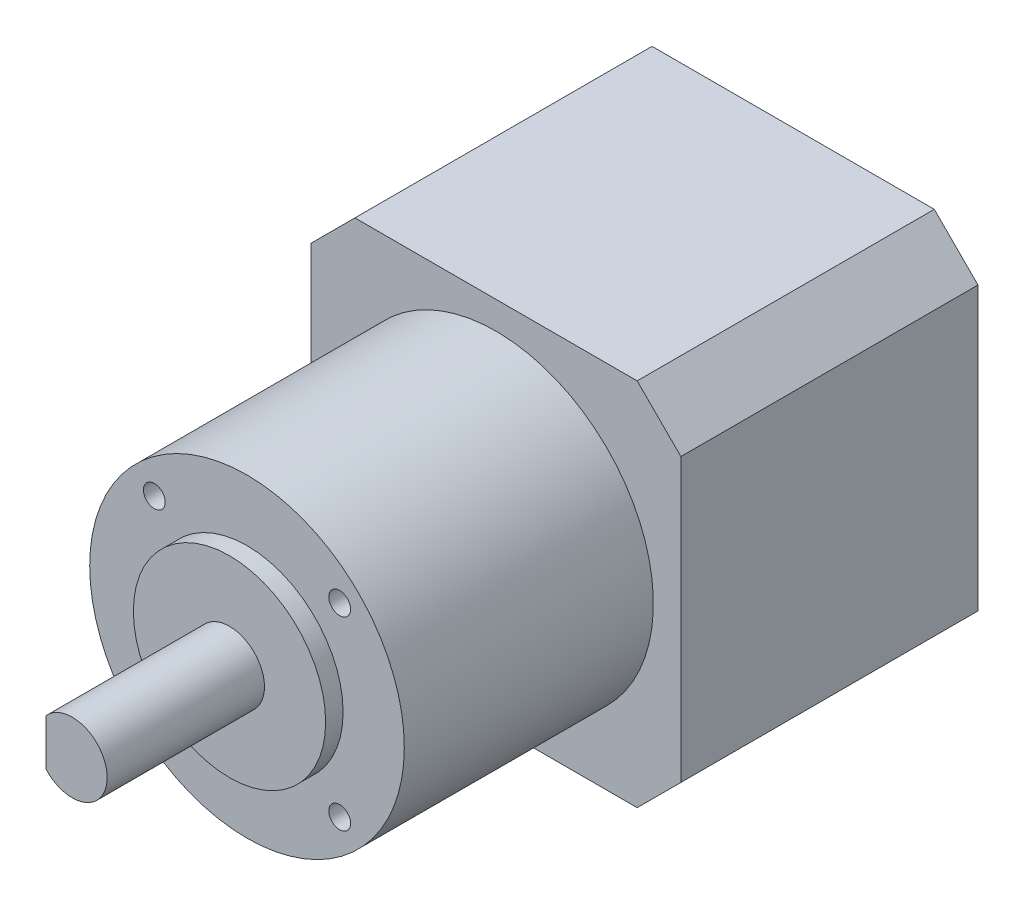
ISO-10303-21;
HEADER;
FILE_DESCRIPTION(('STEP AP214'),'2;1');
FILE_NAME('part.step','',(''),(''),'','','');
FILE_SCHEMA(('AUTOMOTIVE_DESIGN { 1 0 10303 214 1 1 1 1 }'));
ENDSEC;
DATA;
#1=APPLICATION_CONTEXT('core data for automotive mechanical design processes');
#2=APPLICATION_PROTOCOL_DEFINITION('international standard','automotive_design',2000,#1);
#3=PRODUCT_CONTEXT('',#1,'mechanical');
#4=PRODUCT('Part','Part','',(#3));
#5=PRODUCT_RELATED_PRODUCT_CATEGORY('part','',(#4));
#6=PRODUCT_DEFINITION_FORMATION('','',#4);
#7=PRODUCT_DEFINITION_CONTEXT('part definition',#1,'design');
#8=PRODUCT_DEFINITION('design','',#6,#7);
#9=PRODUCT_DEFINITION_SHAPE('','',#8);
#10=(LENGTH_UNIT() NAMED_UNIT(*) SI_UNIT(.MILLI.,.METRE.));
#11=(NAMED_UNIT(*) PLANE_ANGLE_UNIT() SI_UNIT($,.RADIAN.));
#12=(NAMED_UNIT(*) SI_UNIT($,.STERADIAN.) SOLID_ANGLE_UNIT());
#13=UNCERTAINTY_MEASURE_WITH_UNIT(LENGTH_MEASURE(1.E-05),#10,'distance_accuracy_value','');
#14=(GEOMETRIC_REPRESENTATION_CONTEXT(3) GLOBAL_UNCERTAINTY_ASSIGNED_CONTEXT((#13)) GLOBAL_UNIT_ASSIGNED_CONTEXT((#10,
#11,#12)) REPRESENTATION_CONTEXT('',''));
#15=CARTESIAN_POINT('',(0.,0.,0.));
#16=DIRECTION('',(0.,0.,1.));
#17=DIRECTION('',(1.,0.,0.));
#18=AXIS2_PLACEMENT_3D('',#15,#16,#17);
#19=CARTESIAN_POINT('',(-21.1500000000001,-16.15,34.));
#20=DIRECTION('',(1.,0.,0.));
#21=DIRECTION('',(0.,0.,-1.));
#22=AXIS2_PLACEMENT_3D('',#19,#20,#21);
#23=PLANE('',#22);
#24=DIRECTION('',(0.,-1.,0.));
#25=VECTOR('',#24,1.);
#26=CARTESIAN_POINT('',(-21.15,-16.15,0.));
#27=LINE('',#26,#25);
#28=CARTESIAN_POINT('',(-21.15,16.15,0.));
#29=VERTEX_POINT('',#28);
#30=CARTESIAN_POINT('',(-21.15,-16.15,0.));
#31=VERTEX_POINT('',#30);
#32=EDGE_CURVE('E148',#29,#31,#27,.T.);
#33=ORIENTED_EDGE('',*,*,#32,.T.);
#34=DIRECTION('',(0.,0.,-1.));
#35=VECTOR('',#34,1.);
#36=CARTESIAN_POINT('',(-21.1500000000001,-16.15,34.));
#37=LINE('',#36,#35);
#38=CARTESIAN_POINT('',(-21.1500000000001,-16.15,34.));
#39=VERTEX_POINT('',#38);
#40=EDGE_CURVE('E188',#39,#31,#37,.T.);
#41=ORIENTED_EDGE('',*,*,#40,.F.);
#42=DIRECTION('',(0.,-1.,0.));
#43=VECTOR('',#42,1.);
#44=CARTESIAN_POINT('',(-21.1500000000001,-16.15,34.));
#45=LINE('',#44,#43);
#46=CARTESIAN_POINT('',(-21.15,16.15,34.));
#47=VERTEX_POINT('',#46);
#48=EDGE_CURVE('E170',#47,#39,#45,.T.);
#49=ORIENTED_EDGE('',*,*,#48,.F.);
#50=DIRECTION('',(0.,0.,-1.));
#51=VECTOR('',#50,1.);
#52=CARTESIAN_POINT('',(-21.15,16.15,34.));
#53=LINE('',#52,#51);
#54=EDGE_CURVE('E144',#47,#29,#53,.T.);
#55=ORIENTED_EDGE('',*,*,#54,.T.);
#56=EDGE_LOOP('',(#33,#41,#49,#55));
#57=FACE_BOUND('',#56,.T.);
#58=ADVANCED_FACE('F40',(#57),#23,.F.);
#59=CARTESIAN_POINT('',(-21.1500000000001,-16.15,34.));
#60=DIRECTION('',(0.707106781186548,0.707106781186548,0.));
#61=DIRECTION('',(-0.707106781186549,0.707106781186549,0.));
#62=AXIS2_PLACEMENT_3D('',#59,#60,#61);
#63=PLANE('',#62);
#64=DIRECTION('',(0.707106781186549,-0.707106781186549,0.));
#65=VECTOR('',#64,1.);
#66=CARTESIAN_POINT('',(-21.15,-16.15,0.));
#67=LINE('',#66,#65);
#68=CARTESIAN_POINT('',(-16.15,-21.15,0.));
#69=VERTEX_POINT('',#68);
#70=EDGE_CURVE('E152',#31,#69,#67,.T.);
#71=ORIENTED_EDGE('',*,*,#70,.T.);
#72=DIRECTION('',(0.,0.,-1.));
#73=VECTOR('',#72,1.);
#74=CARTESIAN_POINT('',(-16.15,-21.15,34.));
#75=LINE('',#74,#73);
#76=CARTESIAN_POINT('',(-16.15,-21.15,34.));
#77=VERTEX_POINT('',#76);
#78=EDGE_CURVE('E185',#77,#69,#75,.T.);
#79=ORIENTED_EDGE('',*,*,#78,.F.);
#80=DIRECTION('',(0.707106781186549,-0.707106781186549,0.));
#81=VECTOR('',#80,1.);
#82=CARTESIAN_POINT('',(-21.1500000000001,-16.15,34.));
#83=LINE('',#82,#81);
#84=EDGE_CURVE('E105',#39,#77,#83,.T.);
#85=ORIENTED_EDGE('',*,*,#84,.F.);
#86=ORIENTED_EDGE('',*,*,#40,.T.);
#87=EDGE_LOOP('',(#71,#79,#85,#86));
#88=FACE_BOUND('',#87,.T.);
#89=ADVANCED_FACE('F251',(#88),#63,.F.);
#90=CARTESIAN_POINT('',(-16.15,-21.15,34.));
#91=DIRECTION('',(0.,1.,0.));
#92=DIRECTION('',(0.,0.,1.));
#93=AXIS2_PLACEMENT_3D('',#90,#91,#92);
#94=PLANE('',#93);
#95=DIRECTION('',(1.,0.,0.));
#96=VECTOR('',#95,1.);
#97=CARTESIAN_POINT('',(-16.15,-21.15,0.));
#98=LINE('',#97,#96);
#99=CARTESIAN_POINT('',(16.15,-21.15,0.));
#100=VERTEX_POINT('',#99);
#101=EDGE_CURVE('E155',#69,#100,#98,.T.);
#102=ORIENTED_EDGE('',*,*,#101,.T.);
#103=DIRECTION('',(0.,0.,-1.));
#104=VECTOR('',#103,1.);
#105=CARTESIAN_POINT('',(16.15,-21.15,34.));
#106=LINE('',#105,#104);
#107=CARTESIAN_POINT('',(16.15,-21.15,34.));
#108=VERTEX_POINT('',#107);
#109=EDGE_CURVE('E181',#108,#100,#106,.T.);
#110=ORIENTED_EDGE('',*,*,#109,.F.);
#111=DIRECTION('',(1.,0.,0.));
#112=VECTOR('',#111,1.);
#113=CARTESIAN_POINT('',(-16.15,-21.15,34.));
#114=LINE('',#113,#112);
#115=EDGE_CURVE('E231',#77,#108,#114,.T.);
#116=ORIENTED_EDGE('',*,*,#115,.F.);
#117=ORIENTED_EDGE('',*,*,#78,.T.);
#118=EDGE_LOOP('',(#102,#110,#116,#117));
#119=FACE_BOUND('',#118,.T.);
#120=ADVANCED_FACE('F254',(#119),#94,.F.);
#121=CARTESIAN_POINT('',(16.15,-21.15,34.));
#122=DIRECTION('',(-0.707106781186548,0.707106781186548,0.));
#123=DIRECTION('',(-0.707106781186549,-0.707106781186549,0.));
#124=AXIS2_PLACEMENT_3D('',#121,#122,#123);
#125=PLANE('',#124);
#126=DIRECTION('',(0.707106781186549,0.707106781186549,0.));
#127=VECTOR('',#126,1.);
#128=CARTESIAN_POINT('',(16.15,-21.15,0.));
#129=LINE('',#128,#127);
#130=CARTESIAN_POINT('',(21.15,-16.15,0.));
#131=VERTEX_POINT('',#130);
#132=EDGE_CURVE('E158',#100,#131,#129,.T.);
#133=ORIENTED_EDGE('',*,*,#132,.T.);
#134=DIRECTION('',(0.,0.,-1.));
#135=VECTOR('',#134,1.);
#136=CARTESIAN_POINT('',(21.15,-16.15,34.));
#137=LINE('',#136,#135);
#138=CARTESIAN_POINT('',(21.15,-16.15,34.));
#139=VERTEX_POINT('',#138);
#140=EDGE_CURVE('E177',#139,#131,#137,.T.);
#141=ORIENTED_EDGE('',*,*,#140,.F.);
#142=DIRECTION('',(0.707106781186549,0.707106781186549,0.));
#143=VECTOR('',#142,1.);
#144=CARTESIAN_POINT('',(16.15,-21.15,34.));
#145=LINE('',#144,#143);
#146=EDGE_CURVE('E233',#108,#139,#145,.T.);
#147=ORIENTED_EDGE('',*,*,#146,.F.);
#148=ORIENTED_EDGE('',*,*,#109,.T.);
#149=EDGE_LOOP('',(#133,#141,#147,#148));
#150=FACE_BOUND('',#149,.T.);
#151=ADVANCED_FACE('F239',(#150),#125,.F.);
#152=CARTESIAN_POINT('',(21.15,-16.15,34.));
#153=DIRECTION('',(-1.,0.,0.));
#154=DIRECTION('',(0.,0.,1.));
#155=AXIS2_PLACEMENT_3D('',#152,#153,#154);
#156=PLANE('',#155);
#157=DIRECTION('',(0.,1.,0.));
#158=VECTOR('',#157,1.);
#159=CARTESIAN_POINT('',(21.15,-16.15,0.));
#160=LINE('',#159,#158);
#161=CARTESIAN_POINT('',(21.15,16.15,0.));
#162=VERTEX_POINT('',#161);
#163=EDGE_CURVE('E160',#131,#162,#160,.T.);
#164=ORIENTED_EDGE('',*,*,#163,.T.);
#165=DIRECTION('',(0.,0.,-1.));
#166=VECTOR('',#165,1.);
#167=CARTESIAN_POINT('',(21.15,16.15,34.));
#168=LINE('',#167,#166);
#169=CARTESIAN_POINT('',(21.15,16.15,34.));
#170=VERTEX_POINT('',#169);
#171=EDGE_CURVE('E139',#170,#162,#168,.T.);
#172=ORIENTED_EDGE('',*,*,#171,.F.);
#173=DIRECTION('',(0.,1.,0.));
#174=VECTOR('',#173,1.);
#175=CARTESIAN_POINT('',(21.15,-16.15,34.));
#176=LINE('',#175,#174);
#177=EDGE_CURVE('E127',#139,#170,#176,.T.);
#178=ORIENTED_EDGE('',*,*,#177,.F.);
#179=ORIENTED_EDGE('',*,*,#140,.T.);
#180=EDGE_LOOP('',(#164,#172,#178,#179));
#181=FACE_BOUND('',#180,.T.);
#182=ADVANCED_FACE('F243',(#181),#156,.F.);
#183=CARTESIAN_POINT('',(16.15,21.15,34.));
#184=DIRECTION('',(-0.707106781186548,-0.707106781186548,0.));
#185=DIRECTION('',(0.707106781186549,-0.707106781186549,0.));
#186=AXIS2_PLACEMENT_3D('',#183,#184,#185);
#187=PLANE('',#186);
#188=DIRECTION('',(-0.707106781186549,0.707106781186549,0.));
#189=VECTOR('',#188,1.);
#190=CARTESIAN_POINT('',(16.15,21.15,0.));
#191=LINE('',#190,#189);
#192=CARTESIAN_POINT('',(16.15,21.15,0.));
#193=VERTEX_POINT('',#192);
#194=EDGE_CURVE('E136',#162,#193,#191,.T.);
#195=ORIENTED_EDGE('',*,*,#194,.T.);
#196=DIRECTION('',(0.,0.,-1.));
#197=VECTOR('',#196,1.);
#198=CARTESIAN_POINT('',(16.15,21.15,34.));
#199=LINE('',#198,#197);
#200=CARTESIAN_POINT('',(16.15,21.15,34.));
#201=VERTEX_POINT('',#200);
#202=EDGE_CURVE('E133',#201,#193,#199,.T.);
#203=ORIENTED_EDGE('',*,*,#202,.F.);
#204=DIRECTION('',(-0.707106781186549,0.707106781186549,0.));
#205=VECTOR('',#204,1.);
#206=CARTESIAN_POINT('',(16.15,21.15,34.));
#207=LINE('',#206,#205);
#208=EDGE_CURVE('E120',#170,#201,#207,.T.);
#209=ORIENTED_EDGE('',*,*,#208,.F.);
#210=ORIENTED_EDGE('',*,*,#171,.T.);
#211=EDGE_LOOP('',(#195,#203,#209,#210));
#212=FACE_BOUND('',#211,.T.);
#213=ADVANCED_FACE('F134',(#212),#187,.F.);
#214=CARTESIAN_POINT('',(-16.15,21.15,34.));
#215=DIRECTION('',(0.,-1.,0.));
#216=DIRECTION('',(0.,0.,-1.));
#217=AXIS2_PLACEMENT_3D('',#214,#215,#216);
#218=PLANE('',#217);
#219=DIRECTION('',(-1.,0.,0.));
#220=VECTOR('',#219,1.);
#221=CARTESIAN_POINT('',(-16.15,21.15,0.));
#222=LINE('',#221,#220);
#223=CARTESIAN_POINT('',(-16.15,21.15,0.));
#224=VERTEX_POINT('',#223);
#225=EDGE_CURVE('E165',#193,#224,#222,.T.);
#226=ORIENTED_EDGE('',*,*,#225,.T.);
#227=DIRECTION('',(0.,0.,-1.));
#228=VECTOR('',#227,1.);
#229=CARTESIAN_POINT('',(-16.15,21.15,34.));
#230=LINE('',#229,#228);
#231=CARTESIAN_POINT('',(-16.15,21.15,34.));
#232=VERTEX_POINT('',#231);
#233=EDGE_CURVE('E140',#232,#224,#230,.T.);
#234=ORIENTED_EDGE('',*,*,#233,.F.);
#235=DIRECTION('',(-1.,0.,0.));
#236=VECTOR('',#235,1.);
#237=CARTESIAN_POINT('',(-16.15,21.15,34.));
#238=LINE('',#237,#236);
#239=EDGE_CURVE('E124',#201,#232,#238,.T.);
#240=ORIENTED_EDGE('',*,*,#239,.F.);
#241=ORIENTED_EDGE('',*,*,#202,.T.);
#242=EDGE_LOOP('',(#226,#234,#240,#241));
#243=FACE_BOUND('',#242,.T.);
#244=ADVANCED_FACE('F142',(#243),#218,.F.);
#245=CARTESIAN_POINT('',(-21.15,16.15,34.));
#246=DIRECTION('',(0.707106781186548,-0.707106781186548,0.));
#247=DIRECTION('',(0.707106781186549,0.707106781186549,0.));
#248=AXIS2_PLACEMENT_3D('',#245,#246,#247);
#249=PLANE('',#248);
#250=DIRECTION('',(-0.707106781186549,-0.707106781186549,0.));
#251=VECTOR('',#250,1.);
#252=CARTESIAN_POINT('',(-21.15,16.15,0.));
#253=LINE('',#252,#251);
#254=EDGE_CURVE('E96',#224,#29,#253,.T.);
#255=ORIENTED_EDGE('',*,*,#254,.T.);
#256=ORIENTED_EDGE('',*,*,#54,.F.);
#257=DIRECTION('',(-0.707106781186549,-0.707106781186549,0.));
#258=VECTOR('',#257,1.);
#259=CARTESIAN_POINT('',(-21.15,16.15,34.));
#260=LINE('',#259,#258);
#261=EDGE_CURVE('E63',#232,#47,#260,.T.);
#262=ORIENTED_EDGE('',*,*,#261,.F.);
#263=ORIENTED_EDGE('',*,*,#233,.T.);
#264=EDGE_LOOP('',(#255,#256,#262,#263));
#265=FACE_BOUND('',#264,.T.);
#266=ADVANCED_FACE('F247',(#265),#249,.F.);
#267=CARTESIAN_POINT('',(0.,0.,34.));
#268=DIRECTION('',(0.,0.,-1.));
#269=DIRECTION('',(-1.,0.,0.));
#270=AXIS2_PLACEMENT_3D('',#267,#268,#269);
#271=PLANE('',#270);
#272=CARTESIAN_POINT('',(0.,0.,34.));
#273=DIRECTION('',(0.,0.,-1.));
#274=DIRECTION('',(-1.,0.,0.));
#275=AXIS2_PLACEMENT_3D('',#272,#273,#274);
#276=CIRCLE('',#275,18.);
#277=CARTESIAN_POINT('',(-18.,0.,34.));
#278=VERTEX_POINT('',#277);
#279=EDGE_CURVE('E190',#278,#278,#276,.F.);
#280=ORIENTED_EDGE('',*,*,#279,.F.);
#281=EDGE_LOOP('',(#280));
#282=FACE_BOUND('',#281,.T.);
#283=ORIENTED_EDGE('',*,*,#48,.T.);
#284=ORIENTED_EDGE('',*,*,#84,.T.);
#285=ORIENTED_EDGE('',*,*,#115,.T.);
#286=ORIENTED_EDGE('',*,*,#146,.T.);
#287=ORIENTED_EDGE('',*,*,#177,.T.);
#288=ORIENTED_EDGE('',*,*,#208,.T.);
#289=ORIENTED_EDGE('',*,*,#239,.T.);
#290=ORIENTED_EDGE('',*,*,#261,.T.);
#291=EDGE_LOOP('',(#283,#284,#285,#286,#287,#288,#289,#290));
#292=FACE_BOUND('',#291,.T.);
#293=ADVANCED_FACE('F122',(#282,#292),#271,.F.);
#294=CARTESIAN_POINT('',(0.,0.,0.));
#295=DIRECTION('',(0.,0.,-1.));
#296=DIRECTION('',(-1.,0.,0.));
#297=AXIS2_PLACEMENT_3D('',#294,#295,#296);
#298=PLANE('',#297);
#299=ORIENTED_EDGE('',*,*,#32,.F.);
#300=ORIENTED_EDGE('',*,*,#254,.F.);
#301=ORIENTED_EDGE('',*,*,#225,.F.);
#302=ORIENTED_EDGE('',*,*,#194,.F.);
#303=ORIENTED_EDGE('',*,*,#163,.F.);
#304=ORIENTED_EDGE('',*,*,#132,.F.);
#305=ORIENTED_EDGE('',*,*,#101,.F.);
#306=ORIENTED_EDGE('',*,*,#70,.F.);
#307=EDGE_LOOP('',(#299,#300,#301,#302,#303,#304,#305,#306));
#308=FACE_BOUND('',#307,.T.);
#309=ADVANCED_FACE('F246',(#308),#298,.T.);
#310=CARTESIAN_POINT('',(0.,0.,62.5));
#311=DIRECTION('',(0.,0.,-1.));
#312=DIRECTION('',(-1.,0.,0.));
#313=AXIS2_PLACEMENT_3D('',#310,#311,#312);
#314=CYLINDRICAL_SURFACE('',#313,18.);
#315=CARTESIAN_POINT('',(0.,0.,62.5));
#316=DIRECTION('',(0.,0.,1.));
#317=DIRECTION('',(1.,0.,0.));
#318=AXIS2_PLACEMENT_3D('',#315,#316,#317);
#319=CIRCLE('',#318,18.);
#320=CARTESIAN_POINT('',(18.,0.,62.5));
#321=VERTEX_POINT('',#320);
#322=EDGE_CURVE('E153',#321,#321,#319,.T.);
#323=ORIENTED_EDGE('',*,*,#322,.F.);
#324=EDGE_LOOP('',(#323));
#325=FACE_BOUND('',#324,.T.);
#326=ORIENTED_EDGE('',*,*,#279,.T.);
#327=EDGE_LOOP('',(#326));
#328=FACE_BOUND('',#327,.T.);
#329=ADVANCED_FACE('F334',(#325,#328),#314,.T.);
#330=CARTESIAN_POINT('',(0.,0.,62.5));
#331=DIRECTION('',(0.,0.,1.));
#332=DIRECTION('',(1.,0.,0.));
#333=AXIS2_PLACEMENT_3D('',#330,#331,#332);
#334=PLANE('',#333);
#335=CARTESIAN_POINT('',(-10.6066017177982,10.6066017177982,62.5));
#336=DIRECTION('',(0.,0.,1.));
#337=DIRECTION('',(1.,0.,0.));
#338=AXIS2_PLACEMENT_3D('',#335,#336,#337);
#339=CIRCLE('',#338,1.24999999999999);
#340=CARTESIAN_POINT('',(-9.35660171779822,10.6066017177982,62.5));
#341=VERTEX_POINT('',#340);
#342=EDGE_CURVE('E513',#341,#341,#339,.T.);
#343=ORIENTED_EDGE('',*,*,#342,.F.);
#344=EDGE_LOOP('',(#343));
#345=FACE_BOUND('',#344,.T.);
#346=CARTESIAN_POINT('',(10.6066017177982,10.6066017177982,62.5));
#347=DIRECTION('',(0.,0.,1.));
#348=DIRECTION('',(1.,0.,0.));
#349=AXIS2_PLACEMENT_3D('',#346,#347,#348);
#350=CIRCLE('',#349,1.24999999999999);
#351=CARTESIAN_POINT('',(11.8566017177982,10.6066017177982,62.5));
#352=VERTEX_POINT('',#351);
#353=EDGE_CURVE('E517',#352,#352,#350,.T.);
#354=ORIENTED_EDGE('',*,*,#353,.F.);
#355=EDGE_LOOP('',(#354));
#356=FACE_BOUND('',#355,.T.);
#357=CARTESIAN_POINT('',(-10.6066017177982,-10.6066017177982,62.5));
#358=DIRECTION('',(0.,0.,1.));
#359=DIRECTION('',(1.,0.,0.));
#360=AXIS2_PLACEMENT_3D('',#357,#358,#359);
#361=CIRCLE('',#360,1.24999999999999);
#362=CARTESIAN_POINT('',(-9.35660171779823,-10.6066017177982,62.5));
#363=VERTEX_POINT('',#362);
#364=EDGE_CURVE('E525',#363,#363,#361,.T.);
#365=ORIENTED_EDGE('',*,*,#364,.F.);
#366=EDGE_LOOP('',(#365));
#367=FACE_BOUND('',#366,.T.);
#368=CARTESIAN_POINT('',(10.6066017177982,-10.6066017177982,62.5));
#369=DIRECTION('',(0.,0.,1.));
#370=DIRECTION('',(1.,0.,0.));
#371=AXIS2_PLACEMENT_3D('',#368,#369,#370);
#372=CIRCLE('',#371,1.24999999999999);
#373=CARTESIAN_POINT('',(11.8566017177982,-10.6066017177982,62.5));
#374=VERTEX_POINT('',#373);
#375=EDGE_CURVE('E532',#374,#374,#372,.T.);
#376=ORIENTED_EDGE('',*,*,#375,.F.);
#377=EDGE_LOOP('',(#376));
#378=FACE_BOUND('',#377,.T.);
#379=CARTESIAN_POINT('',(0.,0.,62.5));
#380=DIRECTION('',(0.,0.,1.));
#381=DIRECTION('',(1.,0.,0.));
#382=AXIS2_PLACEMENT_3D('',#379,#380,#381);
#383=CIRCLE('',#382,11.);
#384=CARTESIAN_POINT('',(11.,0.,62.5));
#385=VERTEX_POINT('',#384);
#386=EDGE_CURVE('E213',#385,#385,#383,.T.);
#387=ORIENTED_EDGE('',*,*,#386,.F.);
#388=EDGE_LOOP('',(#387));
#389=FACE_BOUND('',#388,.T.);
#390=ORIENTED_EDGE('',*,*,#322,.T.);
#391=EDGE_LOOP('',(#390));
#392=FACE_BOUND('',#391,.T.);
#393=ADVANCED_FACE('F342',(#345,#356,#367,#378,#389,#392),#334,.T.);
#394=CARTESIAN_POINT('',(0.,0.,64.5));
#395=DIRECTION('',(0.,0.,-1.));
#396=DIRECTION('',(-1.,0.,0.));
#397=AXIS2_PLACEMENT_3D('',#394,#395,#396);
#398=CYLINDRICAL_SURFACE('',#397,11.);
#399=CARTESIAN_POINT('',(0.,0.,64.5));
#400=DIRECTION('',(0.,0.,1.));
#401=DIRECTION('',(1.,0.,0.));
#402=AXIS2_PLACEMENT_3D('',#399,#400,#401);
#403=CIRCLE('',#402,11.);
#404=CARTESIAN_POINT('',(11.,0.,64.5));
#405=VERTEX_POINT('',#404);
#406=EDGE_CURVE('E217',#405,#405,#403,.T.);
#407=ORIENTED_EDGE('',*,*,#406,.F.);
#408=EDGE_LOOP('',(#407));
#409=FACE_BOUND('',#408,.T.);
#410=ORIENTED_EDGE('',*,*,#386,.T.);
#411=EDGE_LOOP('',(#410));
#412=FACE_BOUND('',#411,.T.);
#413=ADVANCED_FACE('F351',(#409,#412),#398,.T.);
#414=CARTESIAN_POINT('',(0.,0.,64.5));
#415=DIRECTION('',(0.,0.,1.));
#416=DIRECTION('',(1.,0.,0.));
#417=AXIS2_PLACEMENT_3D('',#414,#415,#416);
#418=PLANE('',#417);
#419=CARTESIAN_POINT('',(0.,0.,64.5));
#420=DIRECTION('',(0.,0.,1.));
#421=DIRECTION('',(1.,0.,0.));
#422=AXIS2_PLACEMENT_3D('',#419,#420,#421);
#423=CIRCLE('',#422,4.);
#424=CARTESIAN_POINT('',(4.00000000000001,0.,64.5));
#425=VERTEX_POINT('',#424);
#426=EDGE_CURVE('E214',#425,#425,#423,.T.);
#427=ORIENTED_EDGE('',*,*,#426,.F.);
#428=EDGE_LOOP('',(#427));
#429=FACE_BOUND('',#428,.T.);
#430=ORIENTED_EDGE('',*,*,#406,.T.);
#431=EDGE_LOOP('',(#430));
#432=FACE_BOUND('',#431,.T.);
#433=ADVANCED_FACE('F360',(#429,#432),#418,.T.);
#434=CARTESIAN_POINT('',(0.,0.,82.5));
#435=DIRECTION('',(0.,0.,-1.));
#436=DIRECTION('',(-1.,0.,0.));
#437=AXIS2_PLACEMENT_3D('',#434,#435,#436);
#438=CYLINDRICAL_SURFACE('',#437,4.);
#439=CARTESIAN_POINT('',(0.,0.,82.5));
#440=DIRECTION('',(0.,0.,1.));
#441=DIRECTION('',(1.,0.,0.));
#442=AXIS2_PLACEMENT_3D('',#439,#440,#441);
#443=CIRCLE('',#442,4.);
#444=CARTESIAN_POINT('',(-3.,-2.64575131106459,82.5));
#445=VERTEX_POINT('',#444);
#446=CARTESIAN_POINT('',(-3.00000000000001,2.64575131106459,82.5));
#447=VERTEX_POINT('',#446);
#448=EDGE_CURVE('E208',#445,#447,#443,.T.);
#449=ORIENTED_EDGE('',*,*,#448,.F.);
#450=DIRECTION('',(0.,0.,-1.));
#451=VECTOR('',#450,1.);
#452=CARTESIAN_POINT('',(-3.,-2.64575131106459,82.5));
#453=LINE('',#452,#451);
#454=CARTESIAN_POINT('',(-3.,-2.64575131106461,67.5));
#455=VERTEX_POINT('',#454);
#456=EDGE_CURVE('E54',#445,#455,#453,.T.);
#457=ORIENTED_EDGE('',*,*,#456,.T.);
#458=CARTESIAN_POINT('',(0.,0.,67.5));
#459=DIRECTION('',(0.,0.,-1.));
#460=DIRECTION('',(-1.,0.,0.));
#461=AXIS2_PLACEMENT_3D('',#458,#459,#460);
#462=CIRCLE('',#461,4.);
#463=CARTESIAN_POINT('',(-3.,2.64575131106459,67.5));
#464=VERTEX_POINT('',#463);
#465=EDGE_CURVE('E11',#455,#464,#462,.T.);
#466=ORIENTED_EDGE('',*,*,#465,.T.);
#467=DIRECTION('',(0.,0.,-1.));
#468=VECTOR('',#467,1.);
#469=CARTESIAN_POINT('',(-3.00000000000001,2.64575131106459,82.5));
#470=LINE('',#469,#468);
#471=EDGE_CURVE('E197',#464,#447,#470,.F.);
#472=ORIENTED_EDGE('',*,*,#471,.T.);
#473=EDGE_LOOP('',(#449,#457,#466,#472));
#474=FACE_BOUND('',#473,.T.);
#475=ORIENTED_EDGE('',*,*,#426,.T.);
#476=EDGE_LOOP('',(#475));
#477=FACE_BOUND('',#476,.T.);
#478=ADVANCED_FACE('F206',(#474,#477),#438,.T.);
#479=CARTESIAN_POINT('',(0.,0.,82.5));
#480=DIRECTION('',(0.,0.,1.));
#481=DIRECTION('',(1.,0.,0.));
#482=AXIS2_PLACEMENT_3D('',#479,#480,#481);
#483=PLANE('',#482);
#484=DIRECTION('',(0.,1.,0.));
#485=VECTOR('',#484,1.);
#486=CARTESIAN_POINT('',(-3.,0.,82.5));
#487=LINE('',#486,#485);
#488=EDGE_CURVE('E47',#445,#447,#487,.T.);
#489=ORIENTED_EDGE('',*,*,#488,.F.);
#490=ORIENTED_EDGE('',*,*,#448,.T.);
#491=EDGE_LOOP('',(#489,#490));
#492=FACE_BOUND('',#491,.T.);
#493=ADVANCED_FACE('F212',(#492),#483,.T.);
#494=CARTESIAN_POINT('',(0.,0.,67.5));
#495=DIRECTION('',(0.,0.,-1.));
#496=DIRECTION('',(-1.,0.,0.));
#497=AXIS2_PLACEMENT_3D('',#494,#495,#496);
#498=PLANE('',#497);
#499=DIRECTION('',(0.,1.,0.));
#500=VECTOR('',#499,1.);
#501=CARTESIAN_POINT('',(-3.,5.3779483719381,67.5));
#502=LINE('',#501,#500);
#503=EDGE_CURVE('E210',#455,#464,#502,.T.);
#504=ORIENTED_EDGE('',*,*,#503,.T.);
#505=ORIENTED_EDGE('',*,*,#465,.F.);
#506=EDGE_LOOP('',(#504,#505));
#507=FACE_BOUND('',#506,.T.);
#508=ADVANCED_FACE('F388',(#507),#498,.F.);
#509=CARTESIAN_POINT('',(-3.,5.3779483719381,67.5));
#510=DIRECTION('',(1.,0.,0.));
#511=DIRECTION('',(0.,1.,0.));
#512=AXIS2_PLACEMENT_3D('',#509,#510,#511);
#513=PLANE('',#512);
#514=ORIENTED_EDGE('',*,*,#488,.T.);
#515=ORIENTED_EDGE('',*,*,#471,.F.);
#516=ORIENTED_EDGE('',*,*,#503,.F.);
#517=ORIENTED_EDGE('',*,*,#456,.F.);
#518=EDGE_LOOP('',(#514,#515,#516,#517));
#519=FACE_BOUND('',#518,.T.);
#520=ADVANCED_FACE('F196',(#519),#513,.F.);
#521=CARTESIAN_POINT('',(10.6066017177982,-10.6066017177982,55.));
#522=DIRECTION('',(0.,0.,1.));
#523=DIRECTION('',(1.,0.,0.));
#524=AXIS2_PLACEMENT_3D('',#521,#522,#523);
#525=CONICAL_SURFACE('',#524,1.24999999999999,1.02974425867665);
#526=CARTESIAN_POINT('',(10.6066017177982,-10.6066017177982,54.2489242262155));
#527=VERTEX_POINT('',#526);
#528=VERTEX_LOOP('',#527);
#529=FACE_BOUND('',#528,.T.);
#530=CARTESIAN_POINT('',(10.6066017177982,-10.6066017177982,55.));
#531=DIRECTION('',(0.,0.,1.));
#532=DIRECTION('',(1.,0.,0.));
#533=AXIS2_PLACEMENT_3D('',#530,#531,#532);
#534=CIRCLE('',#533,1.24999999999999);
#535=CARTESIAN_POINT('',(11.8566017177982,-10.6066017177982,55.));
#536=VERTEX_POINT('',#535);
#537=EDGE_CURVE('E535',#536,#536,#534,.T.);
#538=ORIENTED_EDGE('',*,*,#537,.T.);
#539=EDGE_LOOP('',(#538));
#540=FACE_BOUND('',#539,.T.);
#541=ADVANCED_FACE('F406',(#529,#540),#525,.F.);
#542=CARTESIAN_POINT('',(10.6066017177982,-10.6066017177982,62.5));
#543=DIRECTION('',(0.,0.,1.));
#544=DIRECTION('',(1.,0.,0.));
#545=AXIS2_PLACEMENT_3D('',#542,#543,#544);
#546=CYLINDRICAL_SURFACE('',#545,1.24999999999999);
#547=ORIENTED_EDGE('',*,*,#537,.F.);
#548=EDGE_LOOP('',(#547));
#549=FACE_BOUND('',#548,.T.);
#550=ORIENTED_EDGE('',*,*,#375,.T.);
#551=EDGE_LOOP('',(#550));
#552=FACE_BOUND('',#551,.T.);
#553=ADVANCED_FACE('F415',(#549,#552),#546,.F.);
#554=CARTESIAN_POINT('',(-10.6066017177982,-10.6066017177982,55.));
#555=DIRECTION('',(0.,0.,1.));
#556=DIRECTION('',(1.,0.,0.));
#557=AXIS2_PLACEMENT_3D('',#554,#555,#556);
#558=CONICAL_SURFACE('',#557,1.24999999999999,1.02974425867665);
#559=CARTESIAN_POINT('',(-10.6066017177982,-10.6066017177982,54.2489242262155));
#560=VERTEX_POINT('',#559);
#561=VERTEX_LOOP('',#560);
#562=FACE_BOUND('',#561,.T.);
#563=CARTESIAN_POINT('',(-10.6066017177982,-10.6066017177982,55.));
#564=DIRECTION('',(0.,0.,1.));
#565=DIRECTION('',(1.,0.,0.));
#566=AXIS2_PLACEMENT_3D('',#563,#564,#565);
#567=CIRCLE('',#566,1.24999999999999);
#568=CARTESIAN_POINT('',(-9.35660171779823,-10.6066017177982,55.));
#569=VERTEX_POINT('',#568);
#570=EDGE_CURVE('E528',#569,#569,#567,.T.);
#571=ORIENTED_EDGE('',*,*,#570,.T.);
#572=EDGE_LOOP('',(#571));
#573=FACE_BOUND('',#572,.T.);
#574=ADVANCED_FACE('F426',(#562,#573),#558,.F.);
#575=CARTESIAN_POINT('',(-10.6066017177982,-10.6066017177982,62.5));
#576=DIRECTION('',(0.,0.,1.));
#577=DIRECTION('',(1.,0.,0.));
#578=AXIS2_PLACEMENT_3D('',#575,#576,#577);
#579=CYLINDRICAL_SURFACE('',#578,1.24999999999999);
#580=ORIENTED_EDGE('',*,*,#570,.F.);
#581=EDGE_LOOP('',(#580));
#582=FACE_BOUND('',#581,.T.);
#583=ORIENTED_EDGE('',*,*,#364,.T.);
#584=EDGE_LOOP('',(#583));
#585=FACE_BOUND('',#584,.T.);
#586=ADVANCED_FACE('F437',(#582,#585),#579,.F.);
#587=CARTESIAN_POINT('',(10.6066017177982,10.6066017177982,55.));
#588=DIRECTION('',(0.,0.,1.));
#589=DIRECTION('',(1.,0.,0.));
#590=AXIS2_PLACEMENT_3D('',#587,#588,#589);
#591=CONICAL_SURFACE('',#590,1.24999999999999,1.02974425867665);
#592=CARTESIAN_POINT('',(10.6066017177982,10.6066017177982,54.2489242262155));
#593=VERTEX_POINT('',#592);
#594=VERTEX_LOOP('',#593);
#595=FACE_BOUND('',#594,.T.);
#596=CARTESIAN_POINT('',(10.6066017177982,10.6066017177982,55.));
#597=DIRECTION('',(0.,0.,1.));
#598=DIRECTION('',(1.,0.,0.));
#599=AXIS2_PLACEMENT_3D('',#596,#597,#598);
#600=CIRCLE('',#599,1.24999999999999);
#601=CARTESIAN_POINT('',(11.8566017177982,10.6066017177982,55.));
#602=VERTEX_POINT('',#601);
#603=EDGE_CURVE('E522',#602,#602,#600,.T.);
#604=ORIENTED_EDGE('',*,*,#603,.T.);
#605=EDGE_LOOP('',(#604));
#606=FACE_BOUND('',#605,.T.);
#607=ADVANCED_FACE('F447',(#595,#606),#591,.F.);
#608=CARTESIAN_POINT('',(10.6066017177982,10.6066017177982,62.5));
#609=DIRECTION('',(0.,0.,1.));
#610=DIRECTION('',(1.,0.,0.));
#611=AXIS2_PLACEMENT_3D('',#608,#609,#610);
#612=CYLINDRICAL_SURFACE('',#611,1.24999999999999);
#613=ORIENTED_EDGE('',*,*,#603,.F.);
#614=EDGE_LOOP('',(#613));
#615=FACE_BOUND('',#614,.T.);
#616=ORIENTED_EDGE('',*,*,#353,.T.);
#617=EDGE_LOOP('',(#616));
#618=FACE_BOUND('',#617,.T.);
#619=ADVANCED_FACE('F457',(#615,#618),#612,.F.);
#620=CARTESIAN_POINT('',(-10.6066017177983,10.6066017177982,55.));
#621=DIRECTION('',(0.,0.,1.));
#622=DIRECTION('',(1.,0.,0.));
#623=AXIS2_PLACEMENT_3D('',#620,#621,#622);
#624=CONICAL_SURFACE('',#623,1.24999999999999,1.02974425867665);
#625=CARTESIAN_POINT('',(-10.6066017177983,10.6066017177982,54.2489242262155));
#626=VERTEX_POINT('',#625);
#627=VERTEX_LOOP('',#626);
#628=FACE_BOUND('',#627,.T.);
#629=CARTESIAN_POINT('',(-10.6066017177983,10.6066017177982,55.));
#630=DIRECTION('',(0.,0.,1.));
#631=DIRECTION('',(1.,0.,0.));
#632=AXIS2_PLACEMENT_3D('',#629,#630,#631);
#633=CIRCLE('',#632,1.24999999999999);
#634=CARTESIAN_POINT('',(-9.35660171779828,10.6066017177982,55.));
#635=VERTEX_POINT('',#634);
#636=EDGE_CURVE('E510',#635,#635,#633,.T.);
#637=ORIENTED_EDGE('',*,*,#636,.T.);
#638=EDGE_LOOP('',(#637));
#639=FACE_BOUND('',#638,.T.);
#640=ADVANCED_FACE('F467',(#628,#639),#624,.F.);
#641=CARTESIAN_POINT('',(-10.6066017177982,10.6066017177982,62.5));
#642=DIRECTION('',(0.,0.,1.));
#643=DIRECTION('',(1.,0.,0.));
#644=AXIS2_PLACEMENT_3D('',#641,#642,#643);
#645=CYLINDRICAL_SURFACE('',#644,1.24999999999999);
#646=ORIENTED_EDGE('',*,*,#636,.F.);
#647=EDGE_LOOP('',(#646));
#648=FACE_BOUND('',#647,.T.);
#649=ORIENTED_EDGE('',*,*,#342,.T.);
#650=EDGE_LOOP('',(#649));
#651=FACE_BOUND('',#650,.T.);
#652=ADVANCED_FACE('F478',(#648,#651),#645,.F.);
#653=CLOSED_SHELL('',(#58,#89,#120,#151,#182,#213,#244,#266,#293,#309,#329,#393,#413,#433,#478,
#493,#508,#520,#541,#553,#574,#586,#607,#619,#640,#652));
#654=MANIFOLD_SOLID_BREP('B2',#653);
#655=ADVANCED_BREP_SHAPE_REPRESENTATION('',(#18,#654),#14);
#656=SHAPE_DEFINITION_REPRESENTATION(#9,#655);
ENDSEC;
END-ISO-10303-21;
